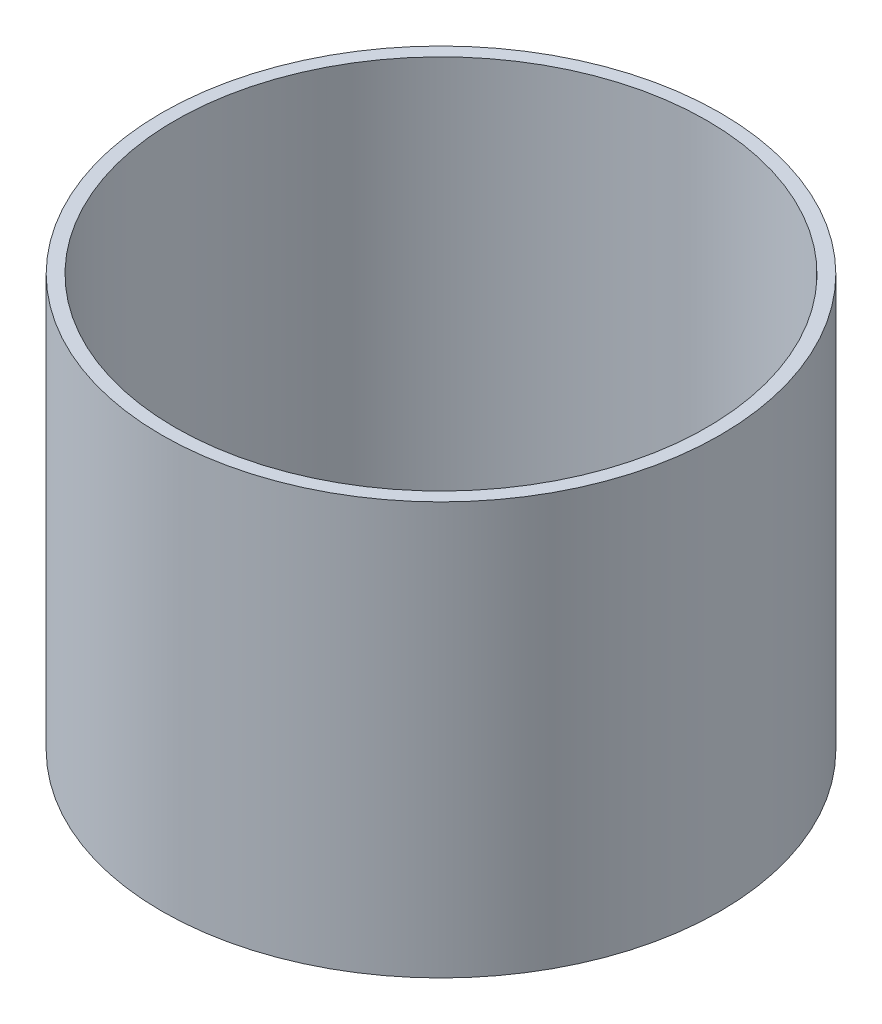
ISO-10303-21;
HEADER;
FILE_DESCRIPTION(('STEP AP214'),'2;1');
FILE_NAME('part.step','',(''),(''),'','','');
FILE_SCHEMA(('AUTOMOTIVE_DESIGN { 1 0 10303 214 1 1 1 1 }'));
ENDSEC;
DATA;
#1=APPLICATION_CONTEXT('core data for automotive mechanical design processes');
#2=APPLICATION_PROTOCOL_DEFINITION('international standard','automotive_design',2000,#1);
#3=PRODUCT_CONTEXT('',#1,'mechanical');
#4=PRODUCT('Part','Part','',(#3));
#5=PRODUCT_RELATED_PRODUCT_CATEGORY('part','',(#4));
#6=PRODUCT_DEFINITION_FORMATION('','',#4);
#7=PRODUCT_DEFINITION_CONTEXT('part definition',#1,'design');
#8=PRODUCT_DEFINITION('design','',#6,#7);
#9=PRODUCT_DEFINITION_SHAPE('','',#8);
#10=(LENGTH_UNIT() NAMED_UNIT(*) SI_UNIT(.MILLI.,.METRE.));
#11=(NAMED_UNIT(*) PLANE_ANGLE_UNIT() SI_UNIT($,.RADIAN.));
#12=(NAMED_UNIT(*) SI_UNIT($,.STERADIAN.) SOLID_ANGLE_UNIT());
#13=UNCERTAINTY_MEASURE_WITH_UNIT(LENGTH_MEASURE(1.E-05),#10,'distance_accuracy_value','');
#14=(GEOMETRIC_REPRESENTATION_CONTEXT(3) GLOBAL_UNCERTAINTY_ASSIGNED_CONTEXT((#13)) GLOBAL_UNIT_ASSIGNED_CONTEXT((#10,
#11,#12)) REPRESENTATION_CONTEXT('',''));
#15=CARTESIAN_POINT('',(0.,0.,0.));
#16=DIRECTION('',(0.,0.,1.));
#17=DIRECTION('',(1.,0.,0.));
#18=AXIS2_PLACEMENT_3D('',#15,#16,#17);
#19=CARTESIAN_POINT('',(0.,137.85088,0.));
#20=DIRECTION('',(0.,1.,0.));
#21=DIRECTION('',(0.,0.,1.));
#22=AXIS2_PLACEMENT_3D('',#19,#20,#21);
#23=PLANE('',#22);
#24=CARTESIAN_POINT('',(0.,137.85088,0.));
#25=DIRECTION('',(0.,1.,0.));
#26=DIRECTION('',(0.,0.,1.));
#27=AXIS2_PLACEMENT_3D('',#24,#25,#26);
#28=CIRCLE('',#27,93.345);
#29=CARTESIAN_POINT('',(0.,137.85088,93.345));
#30=VERTEX_POINT('',#29);
#31=EDGE_CURVE('E10',#30,#30,#28,.T.);
#32=ORIENTED_EDGE('',*,*,#31,.T.);
#33=EDGE_LOOP('',(#32));
#34=FACE_BOUND('',#33,.T.);
#35=CARTESIAN_POINT('',(0.,137.85088,0.));
#36=DIRECTION('',(0.,1.,0.));
#37=DIRECTION('',(0.,0.,1.));
#38=AXIS2_PLACEMENT_3D('',#35,#36,#37);
#39=CIRCLE('',#38,88.9);
#40=CARTESIAN_POINT('',(0.,137.85088,88.9));
#41=VERTEX_POINT('',#40);
#42=EDGE_CURVE('E50',#41,#41,#39,.T.);
#43=ORIENTED_EDGE('',*,*,#42,.F.);
#44=EDGE_LOOP('',(#43));
#45=FACE_BOUND('',#44,.T.);
#46=ADVANCED_FACE('F37',(#34,#45),#23,.T.);
#47=CARTESIAN_POINT('',(0.,0.,0.));
#48=DIRECTION('',(0.,1.,0.));
#49=DIRECTION('',(0.,0.,1.));
#50=AXIS2_PLACEMENT_3D('',#47,#48,#49);
#51=PLANE('',#50);
#52=CARTESIAN_POINT('',(0.,0.,0.));
#53=DIRECTION('',(0.,1.,0.));
#54=DIRECTION('',(0.,0.,1.));
#55=AXIS2_PLACEMENT_3D('',#52,#53,#54);
#56=CIRCLE('',#55,93.345);
#57=CARTESIAN_POINT('',(0.,0.,93.345));
#58=VERTEX_POINT('',#57);
#59=EDGE_CURVE('E41',#58,#58,#56,.T.);
#60=ORIENTED_EDGE('',*,*,#59,.F.);
#61=EDGE_LOOP('',(#60));
#62=FACE_BOUND('',#61,.T.);
#63=CARTESIAN_POINT('',(0.,0.,0.));
#64=DIRECTION('',(0.,1.,0.));
#65=DIRECTION('',(0.,0.,1.));
#66=AXIS2_PLACEMENT_3D('',#63,#64,#65);
#67=CIRCLE('',#66,88.9);
#68=CARTESIAN_POINT('',(0.,0.,88.9));
#69=VERTEX_POINT('',#68);
#70=EDGE_CURVE('E52',#69,#69,#67,.T.);
#71=ORIENTED_EDGE('',*,*,#70,.T.);
#72=EDGE_LOOP('',(#71));
#73=FACE_BOUND('',#72,.T.);
#74=ADVANCED_FACE('F64',(#62,#73),#51,.F.);
#75=CARTESIAN_POINT('',(0.,137.85088,0.));
#76=DIRECTION('',(0.,-1.,0.));
#77=DIRECTION('',(0.,0.,-1.));
#78=AXIS2_PLACEMENT_3D('',#75,#76,#77);
#79=CYLINDRICAL_SURFACE('',#78,93.345);
#80=ORIENTED_EDGE('',*,*,#31,.F.);
#81=EDGE_LOOP('',(#80));
#82=FACE_BOUND('',#81,.T.);
#83=ORIENTED_EDGE('',*,*,#59,.T.);
#84=EDGE_LOOP('',(#83));
#85=FACE_BOUND('',#84,.T.);
#86=ADVANCED_FACE('F39',(#82,#85),#79,.T.);
#87=CARTESIAN_POINT('',(0.,137.85088,0.));
#88=DIRECTION('',(0.,-1.,0.));
#89=DIRECTION('',(0.,0.,-1.));
#90=AXIS2_PLACEMENT_3D('',#87,#88,#89);
#91=CYLINDRICAL_SURFACE('',#90,88.9);
#92=ORIENTED_EDGE('',*,*,#42,.T.);
#93=EDGE_LOOP('',(#92));
#94=FACE_BOUND('',#93,.T.);
#95=ORIENTED_EDGE('',*,*,#70,.F.);
#96=EDGE_LOOP('',(#95));
#97=FACE_BOUND('',#96,.T.);
#98=ADVANCED_FACE('F60',(#94,#97),#91,.F.);
#99=CLOSED_SHELL('',(#46,#74,#86,#98));
#100=MANIFOLD_SOLID_BREP('B2',#99);
#101=ADVANCED_BREP_SHAPE_REPRESENTATION('',(#18,#100),#14);
#102=SHAPE_DEFINITION_REPRESENTATION(#9,#101);
ENDSEC;
END-ISO-10303-21;
